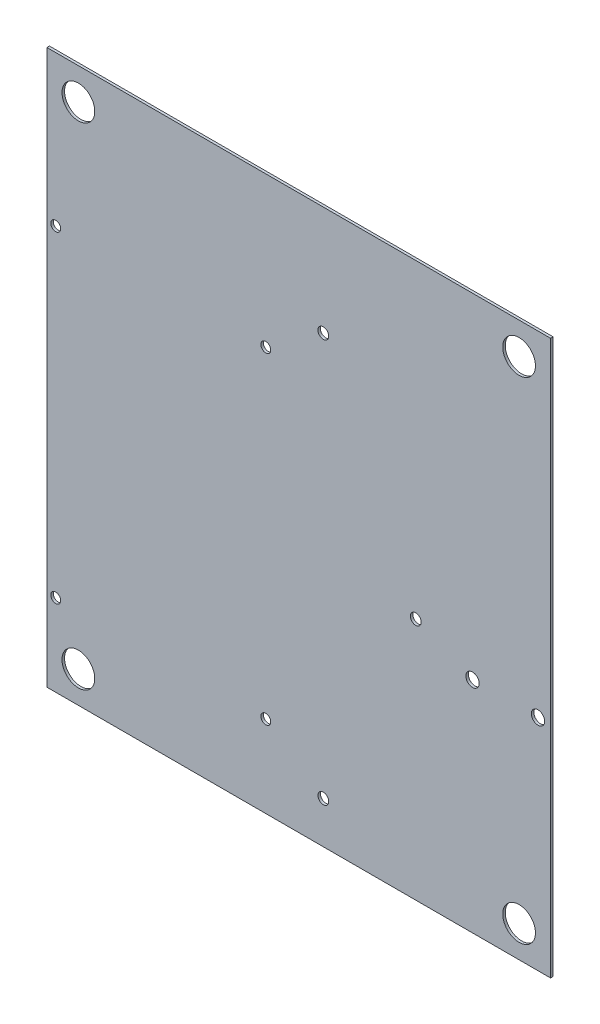
ISO-10303-21;
HEADER;
FILE_DESCRIPTION(('STEP AP214'),'2;1');
FILE_NAME('part.step','',(''),(''),'','','');
FILE_SCHEMA(('AUTOMOTIVE_DESIGN { 1 0 10303 214 1 1 1 1 }'));
ENDSEC;
DATA;
#1=APPLICATION_CONTEXT('core data for automotive mechanical design processes');
#2=APPLICATION_PROTOCOL_DEFINITION('international standard','automotive_design',2000,#1);
#3=PRODUCT_CONTEXT('',#1,'mechanical');
#4=PRODUCT('Part','Part','',(#3));
#5=PRODUCT_RELATED_PRODUCT_CATEGORY('part','',(#4));
#6=PRODUCT_DEFINITION_FORMATION('','',#4);
#7=PRODUCT_DEFINITION_CONTEXT('part definition',#1,'design');
#8=PRODUCT_DEFINITION('design','',#6,#7);
#9=PRODUCT_DEFINITION_SHAPE('','',#8);
#10=(LENGTH_UNIT() NAMED_UNIT(*) SI_UNIT(.MILLI.,.METRE.));
#11=(NAMED_UNIT(*) PLANE_ANGLE_UNIT() SI_UNIT($,.RADIAN.));
#12=(NAMED_UNIT(*) SI_UNIT($,.STERADIAN.) SOLID_ANGLE_UNIT());
#13=UNCERTAINTY_MEASURE_WITH_UNIT(LENGTH_MEASURE(1.E-05),#10,'distance_accuracy_value','');
#14=(GEOMETRIC_REPRESENTATION_CONTEXT(3) GLOBAL_UNCERTAINTY_ASSIGNED_CONTEXT((#13)) GLOBAL_UNIT_ASSIGNED_CONTEXT((#10,
#11,#12)) REPRESENTATION_CONTEXT('',''));
#15=CARTESIAN_POINT('',(0.,0.,0.));
#16=DIRECTION('',(0.,0.,1.));
#17=DIRECTION('',(1.,0.,0.));
#18=AXIS2_PLACEMENT_3D('',#15,#16,#17);
#19=CARTESIAN_POINT('',(0.,0.,1.));
#20=DIRECTION('',(0.,0.,1.));
#21=DIRECTION('',(1.,0.,0.));
#22=AXIS2_PLACEMENT_3D('',#19,#20,#21);
#23=PLANE('',#22);
#24=CARTESIAN_POINT('',(69.0000000000001,-22.92,1.));
#25=DIRECTION('',(0.,0.,1.));
#26=DIRECTION('',(1.,0.,0.));
#27=AXIS2_PLACEMENT_3D('',#24,#25,#26);
#28=CIRCLE('',#27,2.65);
#29=CARTESIAN_POINT('',(71.6500000000001,-22.92,1.));
#30=VERTEX_POINT('',#29);
#31=EDGE_CURVE('E175',#30,#30,#28,.T.);
#32=ORIENTED_EDGE('',*,*,#31,.F.);
#33=EDGE_LOOP('',(#32));
#34=FACE_BOUND('',#33,.T.);
#35=CARTESIAN_POINT('',(-13.085,-77.495,1.));
#36=DIRECTION('',(0.,0.,1.));
#37=DIRECTION('',(1.,0.,0.));
#38=AXIS2_PLACEMENT_3D('',#35,#36,#37);
#39=CIRCLE('',#38,1.96999999999999);
#40=CARTESIAN_POINT('',(-11.115,-77.495,1.));
#41=VERTEX_POINT('',#40);
#42=EDGE_CURVE('E163',#41,#41,#39,.T.);
#43=ORIENTED_EDGE('',*,*,#42,.F.);
#44=EDGE_LOOP('',(#43));
#45=FACE_BOUND('',#44,.T.);
#46=CARTESIAN_POINT('',(-96.495,50.365,1.));
#47=DIRECTION('',(0.,0.,1.));
#48=DIRECTION('',(1.,0.,0.));
#49=AXIS2_PLACEMENT_3D('',#46,#47,#48);
#50=CIRCLE('',#49,1.97);
#51=CARTESIAN_POINT('',(-94.525,50.365,1.));
#52=VERTEX_POINT('',#51);
#53=EDGE_CURVE('E151',#52,#52,#50,.T.);
#54=ORIENTED_EDGE('',*,*,#53,.F.);
#55=EDGE_LOOP('',(#54));
#56=FACE_BOUND('',#55,.T.);
#57=CARTESIAN_POINT('',(9.75999999999997,66.65,1.));
#58=DIRECTION('',(0.,0.,1.));
#59=DIRECTION('',(1.,0.,0.));
#60=AXIS2_PLACEMENT_3D('',#57,#58,#59);
#61=CIRCLE('',#60,2.15265);
#62=CARTESIAN_POINT('',(11.91265,66.65,1.));
#63=VERTEX_POINT('',#62);
#64=EDGE_CURVE('E139',#63,#63,#61,.T.);
#65=ORIENTED_EDGE('',*,*,#64,.F.);
#66=EDGE_LOOP('',(#65));
#67=FACE_BOUND('',#66,.T.);
#68=CARTESIAN_POINT('',(-87.5,-97.5,1.));
#69=DIRECTION('',(0.,0.,1.));
#70=DIRECTION('',(1.,0.,0.));
#71=AXIS2_PLACEMENT_3D('',#68,#69,#70);
#72=CIRCLE('',#71,6.5);
#73=CARTESIAN_POINT('',(-81.,-97.5,1.));
#74=VERTEX_POINT('',#73);
#75=EDGE_CURVE('E127',#74,#74,#72,.T.);
#76=ORIENTED_EDGE('',*,*,#75,.F.);
#77=EDGE_LOOP('',(#76));
#78=FACE_BOUND('',#77,.T.);
#79=CARTESIAN_POINT('',(87.5,97.5,1.));
#80=DIRECTION('',(0.,0.,1.));
#81=DIRECTION('',(1.,0.,0.));
#82=AXIS2_PLACEMENT_3D('',#79,#80,#81);
#83=CIRCLE('',#82,6.5);
#84=CARTESIAN_POINT('',(94.,97.5,1.));
#85=VERTEX_POINT('',#84);
#86=EDGE_CURVE('E115',#85,#85,#83,.T.);
#87=ORIENTED_EDGE('',*,*,#86,.F.);
#88=EDGE_LOOP('',(#87));
#89=FACE_BOUND('',#88,.T.);
#90=DIRECTION('',(0.,1.,0.));
#91=VECTOR('',#90,1.);
#92=CARTESIAN_POINT('',(100.,110.,1.));
#93=LINE('',#92,#91);
#94=CARTESIAN_POINT('',(100.,-110.,1.));
#95=VERTEX_POINT('',#94);
#96=CARTESIAN_POINT('',(100.,110.,1.));
#97=VERTEX_POINT('',#96);
#98=EDGE_CURVE('E85',#95,#97,#93,.T.);
#99=ORIENTED_EDGE('',*,*,#98,.T.);
#100=DIRECTION('',(-1.,0.,0.));
#101=VECTOR('',#100,1.);
#102=CARTESIAN_POINT('',(-100.,110.,1.));
#103=LINE('',#102,#101);
#104=CARTESIAN_POINT('',(-100.,110.,1.));
#105=VERTEX_POINT('',#104);
#106=EDGE_CURVE('E80',#97,#105,#103,.T.);
#107=ORIENTED_EDGE('',*,*,#106,.T.);
#108=DIRECTION('',(0.,-1.,0.));
#109=VECTOR('',#108,1.);
#110=CARTESIAN_POINT('',(-100.,110.,1.));
#111=LINE('',#110,#109);
#112=CARTESIAN_POINT('',(-100.,-110.,1.));
#113=VERTEX_POINT('',#112);
#114=EDGE_CURVE('E83',#105,#113,#111,.T.);
#115=ORIENTED_EDGE('',*,*,#114,.T.);
#116=DIRECTION('',(1.,0.,0.));
#117=VECTOR('',#116,1.);
#118=CARTESIAN_POINT('',(-100.,-110.,1.));
#119=LINE('',#118,#117);
#120=EDGE_CURVE('E50',#113,#95,#119,.T.);
#121=ORIENTED_EDGE('',*,*,#120,.T.);
#122=EDGE_LOOP('',(#99,#107,#115,#121));
#123=FACE_BOUND('',#122,.T.);
#124=CARTESIAN_POINT('',(-87.5,97.5,1.));
#125=DIRECTION('',(0.,0.,1.));
#126=DIRECTION('',(1.,0.,0.));
#127=AXIS2_PLACEMENT_3D('',#124,#125,#126);
#128=CIRCLE('',#127,6.5);
#129=CARTESIAN_POINT('',(-81.,97.5,1.));
#130=VERTEX_POINT('',#129);
#131=EDGE_CURVE('E100',#130,#130,#128,.T.);
#132=ORIENTED_EDGE('',*,*,#131,.F.);
#133=EDGE_LOOP('',(#132));
#134=FACE_BOUND('',#133,.T.);
#135=CARTESIAN_POINT('',(87.5,-97.5,1.));
#136=DIRECTION('',(0.,0.,1.));
#137=DIRECTION('',(1.,0.,0.));
#138=AXIS2_PLACEMENT_3D('',#135,#136,#137);
#139=CIRCLE('',#138,6.5);
#140=CARTESIAN_POINT('',(94.,-97.5,1.));
#141=VERTEX_POINT('',#140);
#142=EDGE_CURVE('E121',#141,#141,#139,.T.);
#143=ORIENTED_EDGE('',*,*,#142,.F.);
#144=EDGE_LOOP('',(#143));
#145=FACE_BOUND('',#144,.T.);
#146=CARTESIAN_POINT('',(9.75999999999997,-93.37,1.));
#147=DIRECTION('',(0.,0.,1.));
#148=DIRECTION('',(1.,0.,0.));
#149=AXIS2_PLACEMENT_3D('',#146,#147,#148);
#150=CIRCLE('',#149,2.15265);
#151=CARTESIAN_POINT('',(11.91265,-93.37,1.));
#152=VERTEX_POINT('',#151);
#153=EDGE_CURVE('E133',#152,#152,#150,.T.);
#154=ORIENTED_EDGE('',*,*,#153,.F.);
#155=EDGE_LOOP('',(#154));
#156=FACE_BOUND('',#155,.T.);
#157=CARTESIAN_POINT('',(46.46,-13.35,1.));
#158=DIRECTION('',(0.,0.,1.));
#159=DIRECTION('',(1.,0.,0.));
#160=AXIS2_PLACEMENT_3D('',#157,#158,#159);
#161=CIRCLE('',#160,2.15265000000001);
#162=CARTESIAN_POINT('',(48.61265,-13.35,1.));
#163=VERTEX_POINT('',#162);
#164=EDGE_CURVE('E145',#163,#163,#161,.T.);
#165=ORIENTED_EDGE('',*,*,#164,.F.);
#166=EDGE_LOOP('',(#165));
#167=FACE_BOUND('',#166,.T.);
#168=CARTESIAN_POINT('',(-13.085,50.365,1.));
#169=DIRECTION('',(0.,0.,1.));
#170=DIRECTION('',(1.,0.,0.));
#171=AXIS2_PLACEMENT_3D('',#168,#169,#170);
#172=CIRCLE('',#171,1.96999999999999);
#173=CARTESIAN_POINT('',(-11.115,50.365,1.));
#174=VERTEX_POINT('',#173);
#175=EDGE_CURVE('E157',#174,#174,#172,.T.);
#176=ORIENTED_EDGE('',*,*,#175,.F.);
#177=EDGE_LOOP('',(#176));
#178=FACE_BOUND('',#177,.T.);
#179=CARTESIAN_POINT('',(-96.495,-77.495,1.));
#180=DIRECTION('',(0.,0.,1.));
#181=DIRECTION('',(1.,0.,0.));
#182=AXIS2_PLACEMENT_3D('',#179,#180,#181);
#183=CIRCLE('',#182,1.97);
#184=CARTESIAN_POINT('',(-94.525,-77.495,1.));
#185=VERTEX_POINT('',#184);
#186=EDGE_CURVE('E169',#185,#185,#183,.T.);
#187=ORIENTED_EDGE('',*,*,#186,.F.);
#188=EDGE_LOOP('',(#187));
#189=FACE_BOUND('',#188,.T.);
#190=CARTESIAN_POINT('',(95.0000000000001,-22.92,1.));
#191=DIRECTION('',(0.,0.,1.));
#192=DIRECTION('',(1.,0.,0.));
#193=AXIS2_PLACEMENT_3D('',#190,#191,#192);
#194=CIRCLE('',#193,2.65);
#195=CARTESIAN_POINT('',(97.6500000000001,-22.92,1.));
#196=VERTEX_POINT('',#195);
#197=EDGE_CURVE('E181',#196,#196,#194,.T.);
#198=ORIENTED_EDGE('',*,*,#197,.F.);
#199=EDGE_LOOP('',(#198));
#200=FACE_BOUND('',#199,.T.);
#201=ADVANCED_FACE('F33',(#34,#45,#56,#67,#78,#89,#123,#134,#145,#156,#167,#178,#189,#200),#23,.T.);
#202=CARTESIAN_POINT('',(0.,0.,0.));
#203=DIRECTION('',(0.,0.,1.));
#204=DIRECTION('',(1.,0.,0.));
#205=AXIS2_PLACEMENT_3D('',#202,#203,#204);
#206=PLANE('',#205);
#207=DIRECTION('',(0.,1.,0.));
#208=VECTOR('',#207,1.);
#209=CARTESIAN_POINT('',(100.,110.,0.));
#210=LINE('',#209,#208);
#211=CARTESIAN_POINT('',(100.,-110.,0.));
#212=VERTEX_POINT('',#211);
#213=CARTESIAN_POINT('',(100.,110.,0.));
#214=VERTEX_POINT('',#213);
#215=EDGE_CURVE('E97',#212,#214,#210,.T.);
#216=ORIENTED_EDGE('',*,*,#215,.F.);
#217=DIRECTION('',(1.,0.,0.));
#218=VECTOR('',#217,1.);
#219=CARTESIAN_POINT('',(-100.,-110.,0.));
#220=LINE('',#219,#218);
#221=CARTESIAN_POINT('',(-100.,-110.,0.));
#222=VERTEX_POINT('',#221);
#223=EDGE_CURVE('E73',#222,#212,#220,.T.);
#224=ORIENTED_EDGE('',*,*,#223,.F.);
#225=DIRECTION('',(0.,-1.,0.));
#226=VECTOR('',#225,1.);
#227=CARTESIAN_POINT('',(-100.,110.,0.));
#228=LINE('',#227,#226);
#229=CARTESIAN_POINT('',(-100.,110.,0.));
#230=VERTEX_POINT('',#229);
#231=EDGE_CURVE('E67',#230,#222,#228,.T.);
#232=ORIENTED_EDGE('',*,*,#231,.F.);
#233=DIRECTION('',(-1.,0.,0.));
#234=VECTOR('',#233,1.);
#235=CARTESIAN_POINT('',(-100.,110.,0.));
#236=LINE('',#235,#234);
#237=EDGE_CURVE('E89',#214,#230,#236,.T.);
#238=ORIENTED_EDGE('',*,*,#237,.F.);
#239=EDGE_LOOP('',(#216,#224,#232,#238));
#240=FACE_BOUND('',#239,.T.);
#241=CARTESIAN_POINT('',(-87.5,97.5,0.));
#242=DIRECTION('',(0.,0.,1.));
#243=DIRECTION('',(1.,0.,0.));
#244=AXIS2_PLACEMENT_3D('',#241,#242,#243);
#245=CIRCLE('',#244,6.5);
#246=CARTESIAN_POINT('',(-81.,97.5,0.));
#247=VERTEX_POINT('',#246);
#248=EDGE_CURVE('E112',#247,#247,#245,.T.);
#249=ORIENTED_EDGE('',*,*,#248,.T.);
#250=EDGE_LOOP('',(#249));
#251=FACE_BOUND('',#250,.T.);
#252=CARTESIAN_POINT('',(87.5,97.5,0.));
#253=DIRECTION('',(0.,0.,1.));
#254=DIRECTION('',(1.,0.,0.));
#255=AXIS2_PLACEMENT_3D('',#252,#253,#254);
#256=CIRCLE('',#255,6.5);
#257=CARTESIAN_POINT('',(94.,97.5,0.));
#258=VERTEX_POINT('',#257);
#259=EDGE_CURVE('E118',#258,#258,#256,.T.);
#260=ORIENTED_EDGE('',*,*,#259,.T.);
#261=EDGE_LOOP('',(#260));
#262=FACE_BOUND('',#261,.T.);
#263=CARTESIAN_POINT('',(87.5,-97.5,0.));
#264=DIRECTION('',(0.,0.,1.));
#265=DIRECTION('',(1.,0.,0.));
#266=AXIS2_PLACEMENT_3D('',#263,#264,#265);
#267=CIRCLE('',#266,6.5);
#268=CARTESIAN_POINT('',(94.,-97.5,0.));
#269=VERTEX_POINT('',#268);
#270=EDGE_CURVE('E124',#269,#269,#267,.T.);
#271=ORIENTED_EDGE('',*,*,#270,.T.);
#272=EDGE_LOOP('',(#271));
#273=FACE_BOUND('',#272,.T.);
#274=CARTESIAN_POINT('',(-87.5,-97.5,0.));
#275=DIRECTION('',(0.,0.,1.));
#276=DIRECTION('',(1.,0.,0.));
#277=AXIS2_PLACEMENT_3D('',#274,#275,#276);
#278=CIRCLE('',#277,6.5);
#279=CARTESIAN_POINT('',(-81.,-97.5,0.));
#280=VERTEX_POINT('',#279);
#281=EDGE_CURVE('E130',#280,#280,#278,.T.);
#282=ORIENTED_EDGE('',*,*,#281,.T.);
#283=EDGE_LOOP('',(#282));
#284=FACE_BOUND('',#283,.T.);
#285=CARTESIAN_POINT('',(9.75999999999997,-93.37,0.));
#286=DIRECTION('',(0.,0.,1.));
#287=DIRECTION('',(1.,0.,0.));
#288=AXIS2_PLACEMENT_3D('',#285,#286,#287);
#289=CIRCLE('',#288,2.15265);
#290=CARTESIAN_POINT('',(11.91265,-93.37,0.));
#291=VERTEX_POINT('',#290);
#292=EDGE_CURVE('E136',#291,#291,#289,.T.);
#293=ORIENTED_EDGE('',*,*,#292,.T.);
#294=EDGE_LOOP('',(#293));
#295=FACE_BOUND('',#294,.T.);
#296=CARTESIAN_POINT('',(9.75999999999997,66.65,0.));
#297=DIRECTION('',(0.,0.,1.));
#298=DIRECTION('',(1.,0.,0.));
#299=AXIS2_PLACEMENT_3D('',#296,#297,#298);
#300=CIRCLE('',#299,2.15265);
#301=CARTESIAN_POINT('',(11.91265,66.65,0.));
#302=VERTEX_POINT('',#301);
#303=EDGE_CURVE('E142',#302,#302,#300,.T.);
#304=ORIENTED_EDGE('',*,*,#303,.T.);
#305=EDGE_LOOP('',(#304));
#306=FACE_BOUND('',#305,.T.);
#307=CARTESIAN_POINT('',(46.46,-13.35,0.));
#308=DIRECTION('',(0.,0.,1.));
#309=DIRECTION('',(1.,0.,0.));
#310=AXIS2_PLACEMENT_3D('',#307,#308,#309);
#311=CIRCLE('',#310,2.15265000000001);
#312=CARTESIAN_POINT('',(48.61265,-13.35,0.));
#313=VERTEX_POINT('',#312);
#314=EDGE_CURVE('E148',#313,#313,#311,.T.);
#315=ORIENTED_EDGE('',*,*,#314,.T.);
#316=EDGE_LOOP('',(#315));
#317=FACE_BOUND('',#316,.T.);
#318=CARTESIAN_POINT('',(-96.495,50.365,0.));
#319=DIRECTION('',(0.,0.,1.));
#320=DIRECTION('',(1.,0.,0.));
#321=AXIS2_PLACEMENT_3D('',#318,#319,#320);
#322=CIRCLE('',#321,1.97);
#323=CARTESIAN_POINT('',(-94.525,50.365,0.));
#324=VERTEX_POINT('',#323);
#325=EDGE_CURVE('E154',#324,#324,#322,.T.);
#326=ORIENTED_EDGE('',*,*,#325,.T.);
#327=EDGE_LOOP('',(#326));
#328=FACE_BOUND('',#327,.T.);
#329=CARTESIAN_POINT('',(-13.085,50.365,0.));
#330=DIRECTION('',(0.,0.,1.));
#331=DIRECTION('',(1.,0.,0.));
#332=AXIS2_PLACEMENT_3D('',#329,#330,#331);
#333=CIRCLE('',#332,1.96999999999999);
#334=CARTESIAN_POINT('',(-11.115,50.365,0.));
#335=VERTEX_POINT('',#334);
#336=EDGE_CURVE('E160',#335,#335,#333,.T.);
#337=ORIENTED_EDGE('',*,*,#336,.T.);
#338=EDGE_LOOP('',(#337));
#339=FACE_BOUND('',#338,.T.);
#340=CARTESIAN_POINT('',(-13.085,-77.495,0.));
#341=DIRECTION('',(0.,0.,1.));
#342=DIRECTION('',(1.,0.,0.));
#343=AXIS2_PLACEMENT_3D('',#340,#341,#342);
#344=CIRCLE('',#343,1.96999999999999);
#345=CARTESIAN_POINT('',(-11.115,-77.495,0.));
#346=VERTEX_POINT('',#345);
#347=EDGE_CURVE('E166',#346,#346,#344,.T.);
#348=ORIENTED_EDGE('',*,*,#347,.T.);
#349=EDGE_LOOP('',(#348));
#350=FACE_BOUND('',#349,.T.);
#351=CARTESIAN_POINT('',(-96.495,-77.495,0.));
#352=DIRECTION('',(0.,0.,1.));
#353=DIRECTION('',(1.,0.,0.));
#354=AXIS2_PLACEMENT_3D('',#351,#352,#353);
#355=CIRCLE('',#354,1.97);
#356=CARTESIAN_POINT('',(-94.525,-77.495,0.));
#357=VERTEX_POINT('',#356);
#358=EDGE_CURVE('E172',#357,#357,#355,.T.);
#359=ORIENTED_EDGE('',*,*,#358,.T.);
#360=EDGE_LOOP('',(#359));
#361=FACE_BOUND('',#360,.T.);
#362=CARTESIAN_POINT('',(69.0000000000001,-22.92,0.));
#363=DIRECTION('',(0.,0.,1.));
#364=DIRECTION('',(1.,0.,0.));
#365=AXIS2_PLACEMENT_3D('',#362,#363,#364);
#366=CIRCLE('',#365,2.65);
#367=CARTESIAN_POINT('',(71.6500000000001,-22.92,0.));
#368=VERTEX_POINT('',#367);
#369=EDGE_CURVE('E178',#368,#368,#366,.T.);
#370=ORIENTED_EDGE('',*,*,#369,.T.);
#371=EDGE_LOOP('',(#370));
#372=FACE_BOUND('',#371,.T.);
#373=CARTESIAN_POINT('',(95.0000000000001,-22.92,0.));
#374=DIRECTION('',(0.,0.,1.));
#375=DIRECTION('',(1.,0.,0.));
#376=AXIS2_PLACEMENT_3D('',#373,#374,#375);
#377=CIRCLE('',#376,2.65);
#378=CARTESIAN_POINT('',(97.6500000000001,-22.92,0.));
#379=VERTEX_POINT('',#378);
#380=EDGE_CURVE('E184',#379,#379,#377,.T.);
#381=ORIENTED_EDGE('',*,*,#380,.T.);
#382=EDGE_LOOP('',(#381));
#383=FACE_BOUND('',#382,.T.);
#384=ADVANCED_FACE('F108',(#240,#251,#262,#273,#284,#295,#306,#317,#328,#339,#350,#361,#372,
#383),#206,.F.);
#385=CARTESIAN_POINT('',(100.,110.,1.));
#386=DIRECTION('',(-1.,0.,0.));
#387=DIRECTION('',(0.,0.,1.));
#388=AXIS2_PLACEMENT_3D('',#385,#386,#387);
#389=PLANE('',#388);
#390=ORIENTED_EDGE('',*,*,#215,.T.);
#391=DIRECTION('',(0.,0.,-1.));
#392=VECTOR('',#391,1.);
#393=CARTESIAN_POINT('',(100.,110.,1.));
#394=LINE('',#393,#392);
#395=EDGE_CURVE('E11',#97,#214,#394,.T.);
#396=ORIENTED_EDGE('',*,*,#395,.F.);
#397=ORIENTED_EDGE('',*,*,#98,.F.);
#398=DIRECTION('',(0.,0.,-1.));
#399=VECTOR('',#398,1.);
#400=CARTESIAN_POINT('',(100.,-110.,1.));
#401=LINE('',#400,#399);
#402=EDGE_CURVE('E93',#95,#212,#401,.T.);
#403=ORIENTED_EDGE('',*,*,#402,.T.);
#404=EDGE_LOOP('',(#390,#396,#397,#403));
#405=FACE_BOUND('',#404,.T.);
#406=ADVANCED_FACE('F35',(#405),#389,.F.);
#407=CARTESIAN_POINT('',(-100.,110.,1.));
#408=DIRECTION('',(0.,-1.,0.));
#409=DIRECTION('',(0.,0.,-1.));
#410=AXIS2_PLACEMENT_3D('',#407,#408,#409);
#411=PLANE('',#410);
#412=ORIENTED_EDGE('',*,*,#237,.T.);
#413=DIRECTION('',(0.,0.,-1.));
#414=VECTOR('',#413,1.);
#415=CARTESIAN_POINT('',(-100.,110.,1.));
#416=LINE('',#415,#414);
#417=EDGE_CURVE('E42',#105,#230,#416,.T.);
#418=ORIENTED_EDGE('',*,*,#417,.F.);
#419=ORIENTED_EDGE('',*,*,#106,.F.);
#420=ORIENTED_EDGE('',*,*,#395,.T.);
#421=EDGE_LOOP('',(#412,#418,#419,#420));
#422=FACE_BOUND('',#421,.T.);
#423=ADVANCED_FACE('F88',(#422),#411,.F.);
#424=CARTESIAN_POINT('',(-100.,110.,1.));
#425=DIRECTION('',(1.,0.,0.));
#426=DIRECTION('',(0.,0.,-1.));
#427=AXIS2_PLACEMENT_3D('',#424,#425,#426);
#428=PLANE('',#427);
#429=ORIENTED_EDGE('',*,*,#231,.T.);
#430=DIRECTION('',(0.,0.,-1.));
#431=VECTOR('',#430,1.);
#432=CARTESIAN_POINT('',(-100.,-110.,1.));
#433=LINE('',#432,#431);
#434=EDGE_CURVE('E90',#113,#222,#433,.T.);
#435=ORIENTED_EDGE('',*,*,#434,.F.);
#436=ORIENTED_EDGE('',*,*,#114,.F.);
#437=ORIENTED_EDGE('',*,*,#417,.T.);
#438=EDGE_LOOP('',(#429,#435,#436,#437));
#439=FACE_BOUND('',#438,.T.);
#440=ADVANCED_FACE('F91',(#439),#428,.F.);
#441=CARTESIAN_POINT('',(-100.,-110.,1.));
#442=DIRECTION('',(0.,1.,0.));
#443=DIRECTION('',(0.,0.,1.));
#444=AXIS2_PLACEMENT_3D('',#441,#442,#443);
#445=PLANE('',#444);
#446=ORIENTED_EDGE('',*,*,#223,.T.);
#447=ORIENTED_EDGE('',*,*,#402,.F.);
#448=ORIENTED_EDGE('',*,*,#120,.F.);
#449=ORIENTED_EDGE('',*,*,#434,.T.);
#450=EDGE_LOOP('',(#446,#447,#448,#449));
#451=FACE_BOUND('',#450,.T.);
#452=ADVANCED_FACE('F105',(#451),#445,.F.);
#453=CARTESIAN_POINT('',(-87.5,97.5,1.));
#454=DIRECTION('',(0.,0.,-1.));
#455=DIRECTION('',(-1.,0.,0.));
#456=AXIS2_PLACEMENT_3D('',#453,#454,#455);
#457=CYLINDRICAL_SURFACE('',#456,6.5);
#458=ORIENTED_EDGE('',*,*,#131,.T.);
#459=EDGE_LOOP('',(#458));
#460=FACE_BOUND('',#459,.T.);
#461=ORIENTED_EDGE('',*,*,#248,.F.);
#462=EDGE_LOOP('',(#461));
#463=FACE_BOUND('',#462,.T.);
#464=ADVANCED_FACE('F203',(#460,#463),#457,.F.);
#465=CARTESIAN_POINT('',(87.5,97.5,1.));
#466=DIRECTION('',(0.,0.,-1.));
#467=DIRECTION('',(-1.,0.,0.));
#468=AXIS2_PLACEMENT_3D('',#465,#466,#467);
#469=CYLINDRICAL_SURFACE('',#468,6.5);
#470=ORIENTED_EDGE('',*,*,#86,.T.);
#471=EDGE_LOOP('',(#470));
#472=FACE_BOUND('',#471,.T.);
#473=ORIENTED_EDGE('',*,*,#259,.F.);
#474=EDGE_LOOP('',(#473));
#475=FACE_BOUND('',#474,.T.);
#476=ADVANCED_FACE('F249',(#472,#475),#469,.F.);
#477=CARTESIAN_POINT('',(87.5,-97.5,1.));
#478=DIRECTION('',(0.,0.,-1.));
#479=DIRECTION('',(-1.,0.,0.));
#480=AXIS2_PLACEMENT_3D('',#477,#478,#479);
#481=CYLINDRICAL_SURFACE('',#480,6.5);
#482=ORIENTED_EDGE('',*,*,#142,.T.);
#483=EDGE_LOOP('',(#482));
#484=FACE_BOUND('',#483,.T.);
#485=ORIENTED_EDGE('',*,*,#270,.F.);
#486=EDGE_LOOP('',(#485));
#487=FACE_BOUND('',#486,.T.);
#488=ADVANCED_FACE('F257',(#484,#487),#481,.F.);
#489=CARTESIAN_POINT('',(-87.5,-97.5,1.));
#490=DIRECTION('',(0.,0.,-1.));
#491=DIRECTION('',(-1.,0.,0.));
#492=AXIS2_PLACEMENT_3D('',#489,#490,#491);
#493=CYLINDRICAL_SURFACE('',#492,6.5);
#494=ORIENTED_EDGE('',*,*,#75,.T.);
#495=EDGE_LOOP('',(#494));
#496=FACE_BOUND('',#495,.T.);
#497=ORIENTED_EDGE('',*,*,#281,.F.);
#498=EDGE_LOOP('',(#497));
#499=FACE_BOUND('',#498,.T.);
#500=ADVANCED_FACE('F265',(#496,#499),#493,.F.);
#501=CARTESIAN_POINT('',(9.75999999999997,-93.37,1.));
#502=DIRECTION('',(0.,0.,-1.));
#503=DIRECTION('',(-1.,0.,0.));
#504=AXIS2_PLACEMENT_3D('',#501,#502,#503);
#505=CYLINDRICAL_SURFACE('',#504,2.15265);
#506=ORIENTED_EDGE('',*,*,#153,.T.);
#507=EDGE_LOOP('',(#506));
#508=FACE_BOUND('',#507,.T.);
#509=ORIENTED_EDGE('',*,*,#292,.F.);
#510=EDGE_LOOP('',(#509));
#511=FACE_BOUND('',#510,.T.);
#512=ADVANCED_FACE('F274',(#508,#511),#505,.F.);
#513=CARTESIAN_POINT('',(9.75999999999997,66.65,1.));
#514=DIRECTION('',(0.,0.,-1.));
#515=DIRECTION('',(-1.,0.,0.));
#516=AXIS2_PLACEMENT_3D('',#513,#514,#515);
#517=CYLINDRICAL_SURFACE('',#516,2.15265);
#518=ORIENTED_EDGE('',*,*,#64,.T.);
#519=EDGE_LOOP('',(#518));
#520=FACE_BOUND('',#519,.T.);
#521=ORIENTED_EDGE('',*,*,#303,.F.);
#522=EDGE_LOOP('',(#521));
#523=FACE_BOUND('',#522,.T.);
#524=ADVANCED_FACE('F283',(#520,#523),#517,.F.);
#525=CARTESIAN_POINT('',(46.46,-13.35,1.));
#526=DIRECTION('',(0.,0.,-1.));
#527=DIRECTION('',(-1.,0.,0.));
#528=AXIS2_PLACEMENT_3D('',#525,#526,#527);
#529=CYLINDRICAL_SURFACE('',#528,2.15265000000001);
#530=ORIENTED_EDGE('',*,*,#164,.T.);
#531=EDGE_LOOP('',(#530));
#532=FACE_BOUND('',#531,.T.);
#533=ORIENTED_EDGE('',*,*,#314,.F.);
#534=EDGE_LOOP('',(#533));
#535=FACE_BOUND('',#534,.T.);
#536=ADVANCED_FACE('F292',(#532,#535),#529,.F.);
#537=CARTESIAN_POINT('',(-96.495,50.365,1.));
#538=DIRECTION('',(0.,0.,-1.));
#539=DIRECTION('',(-1.,0.,0.));
#540=AXIS2_PLACEMENT_3D('',#537,#538,#539);
#541=CYLINDRICAL_SURFACE('',#540,1.97);
#542=ORIENTED_EDGE('',*,*,#53,.T.);
#543=EDGE_LOOP('',(#542));
#544=FACE_BOUND('',#543,.T.);
#545=ORIENTED_EDGE('',*,*,#325,.F.);
#546=EDGE_LOOP('',(#545));
#547=FACE_BOUND('',#546,.T.);
#548=ADVANCED_FACE('F301',(#544,#547),#541,.F.);
#549=CARTESIAN_POINT('',(-13.085,50.365,1.));
#550=DIRECTION('',(0.,0.,-1.));
#551=DIRECTION('',(-1.,0.,0.));
#552=AXIS2_PLACEMENT_3D('',#549,#550,#551);
#553=CYLINDRICAL_SURFACE('',#552,1.96999999999999);
#554=ORIENTED_EDGE('',*,*,#175,.T.);
#555=EDGE_LOOP('',(#554));
#556=FACE_BOUND('',#555,.T.);
#557=ORIENTED_EDGE('',*,*,#336,.F.);
#558=EDGE_LOOP('',(#557));
#559=FACE_BOUND('',#558,.T.);
#560=ADVANCED_FACE('F310',(#556,#559),#553,.F.);
#561=CARTESIAN_POINT('',(-13.085,-77.495,1.));
#562=DIRECTION('',(0.,0.,-1.));
#563=DIRECTION('',(-1.,0.,0.));
#564=AXIS2_PLACEMENT_3D('',#561,#562,#563);
#565=CYLINDRICAL_SURFACE('',#564,1.96999999999999);
#566=ORIENTED_EDGE('',*,*,#42,.T.);
#567=EDGE_LOOP('',(#566));
#568=FACE_BOUND('',#567,.T.);
#569=ORIENTED_EDGE('',*,*,#347,.F.);
#570=EDGE_LOOP('',(#569));
#571=FACE_BOUND('',#570,.T.);
#572=ADVANCED_FACE('F319',(#568,#571),#565,.F.);
#573=CARTESIAN_POINT('',(-96.495,-77.495,1.));
#574=DIRECTION('',(0.,0.,-1.));
#575=DIRECTION('',(-1.,0.,0.));
#576=AXIS2_PLACEMENT_3D('',#573,#574,#575);
#577=CYLINDRICAL_SURFACE('',#576,1.97);
#578=ORIENTED_EDGE('',*,*,#186,.T.);
#579=EDGE_LOOP('',(#578));
#580=FACE_BOUND('',#579,.T.);
#581=ORIENTED_EDGE('',*,*,#358,.F.);
#582=EDGE_LOOP('',(#581));
#583=FACE_BOUND('',#582,.T.);
#584=ADVANCED_FACE('F328',(#580,#583),#577,.F.);
#585=CARTESIAN_POINT('',(69.0000000000001,-22.92,1.));
#586=DIRECTION('',(0.,0.,-1.));
#587=DIRECTION('',(-1.,0.,0.));
#588=AXIS2_PLACEMENT_3D('',#585,#586,#587);
#589=CYLINDRICAL_SURFACE('',#588,2.65);
#590=ORIENTED_EDGE('',*,*,#31,.T.);
#591=EDGE_LOOP('',(#590));
#592=FACE_BOUND('',#591,.T.);
#593=ORIENTED_EDGE('',*,*,#369,.F.);
#594=EDGE_LOOP('',(#593));
#595=FACE_BOUND('',#594,.T.);
#596=ADVANCED_FACE('F337',(#592,#595),#589,.F.);
#597=CARTESIAN_POINT('',(95.0000000000001,-22.92,1.));
#598=DIRECTION('',(0.,0.,-1.));
#599=DIRECTION('',(-1.,0.,0.));
#600=AXIS2_PLACEMENT_3D('',#597,#598,#599);
#601=CYLINDRICAL_SURFACE('',#600,2.65);
#602=ORIENTED_EDGE('',*,*,#197,.T.);
#603=EDGE_LOOP('',(#602));
#604=FACE_BOUND('',#603,.T.);
#605=ORIENTED_EDGE('',*,*,#380,.F.);
#606=EDGE_LOOP('',(#605));
#607=FACE_BOUND('',#606,.T.);
#608=ADVANCED_FACE('F190',(#604,#607),#601,.F.);
#609=CLOSED_SHELL('',(#201,#384,#406,#423,#440,#452,#464,#476,#488,#500,#512,#524,#536,#548,
#560,#572,#584,#596,#608));
#610=MANIFOLD_SOLID_BREP('B2',#609);
#611=ADVANCED_BREP_SHAPE_REPRESENTATION('',(#18,#610),#14);
#612=SHAPE_DEFINITION_REPRESENTATION(#9,#611);
ENDSEC;
END-ISO-10303-21;
